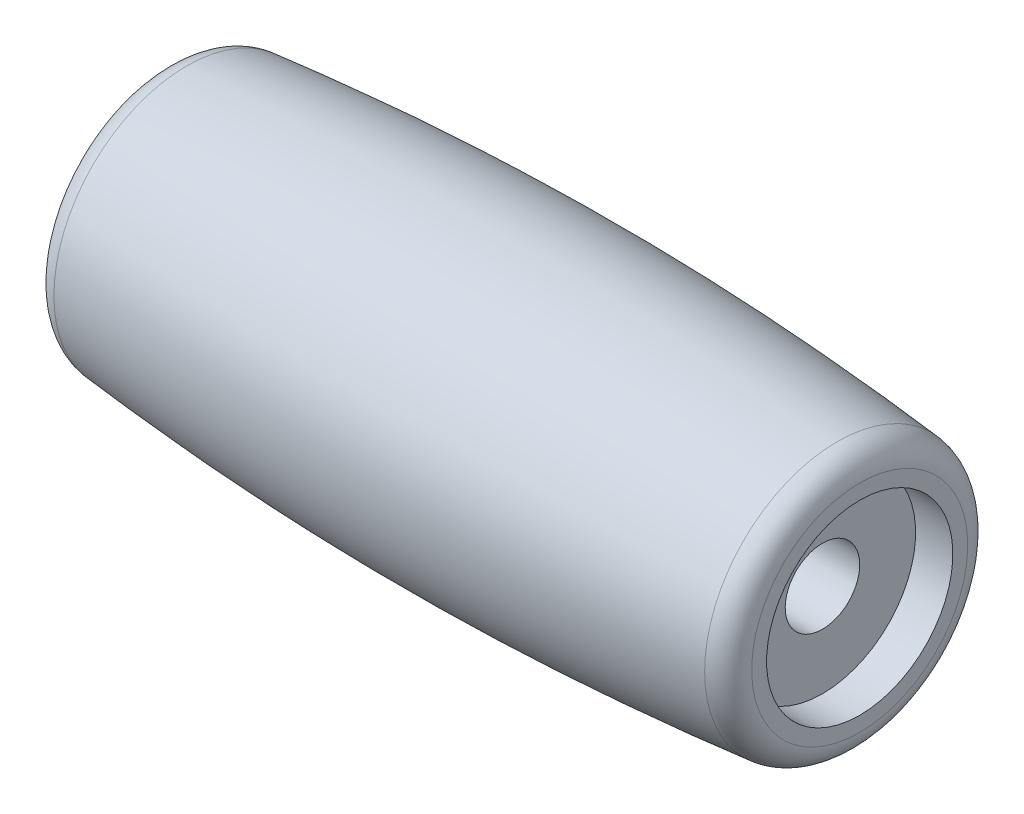
ISO-10303-21;
HEADER;
FILE_DESCRIPTION(('STEP AP214'),'2;1');
FILE_NAME('part.step','',(''),(''),'','','');
FILE_SCHEMA(('AUTOMOTIVE_DESIGN { 1 0 10303 214 1 1 1 1 }'));
ENDSEC;
DATA;
#1=APPLICATION_CONTEXT('core data for automotive mechanical design processes');
#2=APPLICATION_PROTOCOL_DEFINITION('international standard','automotive_design',2000,#1);
#3=PRODUCT_CONTEXT('',#1,'mechanical');
#4=PRODUCT('Part','Part','',(#3));
#5=PRODUCT_RELATED_PRODUCT_CATEGORY('part','',(#4));
#6=PRODUCT_DEFINITION_FORMATION('','',#4);
#7=PRODUCT_DEFINITION_CONTEXT('part definition',#1,'design');
#8=PRODUCT_DEFINITION('design','',#6,#7);
#9=PRODUCT_DEFINITION_SHAPE('','',#8);
#10=(LENGTH_UNIT() NAMED_UNIT(*) SI_UNIT(.MILLI.,.METRE.));
#11=(NAMED_UNIT(*) PLANE_ANGLE_UNIT() SI_UNIT($,.RADIAN.));
#12=(NAMED_UNIT(*) SI_UNIT($,.STERADIAN.) SOLID_ANGLE_UNIT());
#13=UNCERTAINTY_MEASURE_WITH_UNIT(LENGTH_MEASURE(1.E-05),#10,'distance_accuracy_value','');
#14=(GEOMETRIC_REPRESENTATION_CONTEXT(3) GLOBAL_UNCERTAINTY_ASSIGNED_CONTEXT((#13)) GLOBAL_UNIT_ASSIGNED_CONTEXT((#10,
#11,#12)) REPRESENTATION_CONTEXT('',''));
#15=CARTESIAN_POINT('',(0.,0.,0.));
#16=DIRECTION('',(0.,0.,1.));
#17=DIRECTION('',(1.,0.,0.));
#18=AXIS2_PLACEMENT_3D('',#15,#16,#17);
#19=CARTESIAN_POINT('',(-75.,0.,0.));
#20=DIRECTION('',(-1.,0.,0.));
#21=DIRECTION('',(0.,-1.,0.));
#22=AXIS2_PLACEMENT_3D('',#19,#20,#21);
#23=CYLINDRICAL_SURFACE('',#22,3.74999999999998);
#24=CARTESIAN_POINT('',(14.,0.,0.));
#25=DIRECTION('',(-1.,0.,0.));
#26=DIRECTION('',(0.,-1.,0.));
#27=AXIS2_PLACEMENT_3D('',#24,#25,#26);
#28=CIRCLE('',#27,3.74999999999998);
#29=CARTESIAN_POINT('',(14.,-3.74999999999997,0.));
#30=VERTEX_POINT('',#29);
#31=EDGE_CURVE('E10',#30,#30,#28,.T.);
#32=ORIENTED_EDGE('',*,*,#31,.F.);
#33=EDGE_LOOP('',(#32));
#34=FACE_BOUND('',#33,.T.);
#35=CARTESIAN_POINT('',(12.5,0.,0.));
#36=DIRECTION('',(-1.,0.,0.));
#37=DIRECTION('',(0.,-1.,0.));
#38=AXIS2_PLACEMENT_3D('',#35,#36,#37);
#39=CIRCLE('',#38,3.74999999999998);
#40=CARTESIAN_POINT('',(12.5,-3.74999999999997,0.));
#41=VERTEX_POINT('',#40);
#42=EDGE_CURVE('E82',#41,#41,#39,.T.);
#43=ORIENTED_EDGE('',*,*,#42,.T.);
#44=EDGE_LOOP('',(#43));
#45=FACE_BOUND('',#44,.T.);
#46=ADVANCED_FACE('F39',(#34,#45),#23,.F.);
#47=CARTESIAN_POINT('',(14.,3.75,0.));
#48=DIRECTION('',(-1.,0.,0.));
#49=DIRECTION('',(0.,-1.,0.));
#50=AXIS2_PLACEMENT_3D('',#47,#48,#49);
#51=PLANE('',#50);
#52=CARTESIAN_POINT('',(14.,0.,0.));
#53=DIRECTION('',(-1.,0.,0.));
#54=DIRECTION('',(0.,-1.,0.));
#55=AXIS2_PLACEMENT_3D('',#52,#53,#54);
#56=CIRCLE('',#55,4.34837271287945);
#57=CARTESIAN_POINT('',(14.,-4.34837271287943,0.));
#58=VERTEX_POINT('',#57);
#59=EDGE_CURVE('E46',#58,#58,#56,.T.);
#60=ORIENTED_EDGE('',*,*,#59,.F.);
#61=EDGE_LOOP('',(#60));
#62=FACE_BOUND('',#61,.T.);
#63=ORIENTED_EDGE('',*,*,#31,.T.);
#64=EDGE_LOOP('',(#63));
#65=FACE_BOUND('',#64,.T.);
#66=ADVANCED_FACE('F102',(#62,#65),#51,.F.);
#67=CARTESIAN_POINT('',(13.,0.,0.));
#68=DIRECTION('',(-1.,0.,0.));
#69=DIRECTION('',(0.,-1.,0.));
#70=AXIS2_PLACEMENT_3D('',#67,#68,#69);
#71=TOROIDAL_SURFACE('',#70,4.34837271287945,0.999999999999998);
#72=CARTESIAN_POINT('',(13.0997827464215,0.,0.));
#73=DIRECTION('',(-1.,0.,0.));
#74=DIRECTION('',(0.,-1.,0.));
#75=AXIS2_PLACEMENT_3D('',#72,#73,#74);
#76=CIRCLE('',#75,5.34338196083475);
#77=CARTESIAN_POINT('',(13.0997827464215,-5.34338196083474,0.));
#78=VERTEX_POINT('',#77);
#79=EDGE_CURVE('E51',#78,#78,#76,.T.);
#80=ORIENTED_EDGE('',*,*,#79,.F.);
#81=EDGE_LOOP('',(#80));
#82=FACE_BOUND('',#81,.T.);
#83=ORIENTED_EDGE('',*,*,#59,.T.);
#84=EDGE_LOOP('',(#83));
#85=FACE_BOUND('',#84,.T.);
#86=ADVANCED_FACE('F98',(#82,#85),#71,.T.);
#87=CARTESIAN_POINT('',(13.0997827464215,5.34338196083477,0.));
#88=CARTESIAN_POINT('',(8.73325813857914,5.7812711750134,0.));
#89=CARTESIAN_POINT('',(0.000693828203650842,6.21879840432353,0.));
#90=CARTESIAN_POINT('',(-8.73464579498644,5.78113201633955,0.));
#91=CARTESIAN_POINT('',(-13.0997827464215,5.34338196083477,0.));
#92=B_SPLINE_CURVE_WITH_KNOTS('',3,(#87,#88,#89,#90,#91),.UNSPECIFIED.,.F.,.F.,(4,1,4),
(0.0321516724495388,0.499994989031193,0.967838305612847),.UNSPECIFIED.);
#93=CARTESIAN_POINT('',(-75.,0.,0.));
#94=DIRECTION('',(-1.,0.,0.));
#95=AXIS1_PLACEMENT('',#93,#94);
#96=SURFACE_OF_REVOLUTION('',#92,#95);
#97=CARTESIAN_POINT('',(-13.0997827464215,0.,0.));
#98=DIRECTION('',(-1.,0.,0.));
#99=DIRECTION('',(0.,-1.,0.));
#100=AXIS2_PLACEMENT_3D('',#97,#98,#99);
#101=CIRCLE('',#100,5.34338196083476);
#102=CARTESIAN_POINT('',(-13.0997827464215,-5.34338196083475,0.));
#103=VERTEX_POINT('',#102);
#104=EDGE_CURVE('E56',#103,#103,#101,.T.);
#105=ORIENTED_EDGE('',*,*,#104,.F.);
#106=EDGE_LOOP('',(#105));
#107=FACE_BOUND('',#106,.T.);
#108=ORIENTED_EDGE('',*,*,#79,.T.);
#109=EDGE_LOOP('',(#108));
#110=FACE_BOUND('',#109,.T.);
#111=ADVANCED_FACE('F93',(#107,#110),#96,.T.);
#112=CARTESIAN_POINT('',(-13.,0.,0.));
#113=DIRECTION('',(-1.,0.,0.));
#114=DIRECTION('',(0.,-1.,0.));
#115=AXIS2_PLACEMENT_3D('',#112,#113,#114);
#116=TOROIDAL_SURFACE('',#115,4.34837271287945,1.);
#117=CARTESIAN_POINT('',(-14.,0.,0.));
#118=DIRECTION('',(-1.,0.,0.));
#119=DIRECTION('',(0.,-1.,0.));
#120=AXIS2_PLACEMENT_3D('',#117,#118,#119);
#121=CIRCLE('',#120,4.34837271287945);
#122=CARTESIAN_POINT('',(-14.,-4.34837271287944,0.));
#123=VERTEX_POINT('',#122);
#124=EDGE_CURVE('E62',#123,#123,#121,.T.);
#125=ORIENTED_EDGE('',*,*,#124,.F.);
#126=EDGE_LOOP('',(#125));
#127=FACE_BOUND('',#126,.T.);
#128=ORIENTED_EDGE('',*,*,#104,.T.);
#129=EDGE_LOOP('',(#128));
#130=FACE_BOUND('',#129,.T.);
#131=ADVANCED_FACE('F97',(#127,#130),#116,.T.);
#132=CARTESIAN_POINT('',(-14.,3.75,0.));
#133=DIRECTION('',(1.,0.,0.));
#134=DIRECTION('',(0.,1.,0.));
#135=AXIS2_PLACEMENT_3D('',#132,#133,#134);
#136=PLANE('',#135);
#137=CARTESIAN_POINT('',(-14.,0.,0.));
#138=DIRECTION('',(-1.,0.,0.));
#139=DIRECTION('',(0.,-1.,0.));
#140=AXIS2_PLACEMENT_3D('',#137,#138,#139);
#141=CIRCLE('',#140,3.74999999999999);
#142=CARTESIAN_POINT('',(-14.,-3.74999999999998,0.));
#143=VERTEX_POINT('',#142);
#144=EDGE_CURVE('E66',#143,#143,#141,.T.);
#145=ORIENTED_EDGE('',*,*,#144,.F.);
#146=EDGE_LOOP('',(#145));
#147=FACE_BOUND('',#146,.T.);
#148=ORIENTED_EDGE('',*,*,#124,.T.);
#149=EDGE_LOOP('',(#148));
#150=FACE_BOUND('',#149,.T.);
#151=ADVANCED_FACE('F136',(#147,#150),#136,.F.);
#152=CARTESIAN_POINT('',(-75.,0.,0.));
#153=DIRECTION('',(-1.,0.,0.));
#154=DIRECTION('',(0.,-1.,0.));
#155=AXIS2_PLACEMENT_3D('',#152,#153,#154);
#156=CYLINDRICAL_SURFACE('',#155,3.74999999999999);
#157=CARTESIAN_POINT('',(-12.5,0.,0.));
#158=DIRECTION('',(-1.,0.,0.));
#159=DIRECTION('',(0.,-1.,0.));
#160=AXIS2_PLACEMENT_3D('',#157,#158,#159);
#161=CIRCLE('',#160,3.74999999999999);
#162=CARTESIAN_POINT('',(-12.5,-3.74999999999998,0.));
#163=VERTEX_POINT('',#162);
#164=EDGE_CURVE('E70',#163,#163,#161,.T.);
#165=ORIENTED_EDGE('',*,*,#164,.F.);
#166=EDGE_LOOP('',(#165));
#167=FACE_BOUND('',#166,.T.);
#168=ORIENTED_EDGE('',*,*,#144,.T.);
#169=EDGE_LOOP('',(#168));
#170=FACE_BOUND('',#169,.T.);
#171=ADVANCED_FACE('F130',(#167,#170),#156,.F.);
#172=CARTESIAN_POINT('',(-12.5,1.5,0.));
#173=DIRECTION('',(1.,0.,0.));
#174=DIRECTION('',(0.,1.,0.));
#175=AXIS2_PLACEMENT_3D('',#172,#173,#174);
#176=PLANE('',#175);
#177=CARTESIAN_POINT('',(-12.5,0.,0.));
#178=DIRECTION('',(-1.,0.,0.));
#179=DIRECTION('',(0.,-1.,0.));
#180=AXIS2_PLACEMENT_3D('',#177,#178,#179);
#181=CIRCLE('',#180,1.49999999999999);
#182=CARTESIAN_POINT('',(-12.5,-1.49999999999998,0.));
#183=VERTEX_POINT('',#182);
#184=EDGE_CURVE('E74',#183,#183,#181,.T.);
#185=ORIENTED_EDGE('',*,*,#184,.F.);
#186=EDGE_LOOP('',(#185));
#187=FACE_BOUND('',#186,.T.);
#188=ORIENTED_EDGE('',*,*,#164,.T.);
#189=EDGE_LOOP('',(#188));
#190=FACE_BOUND('',#189,.T.);
#191=ADVANCED_FACE('F124',(#187,#190),#176,.F.);
#192=CARTESIAN_POINT('',(-75.,0.,0.));
#193=DIRECTION('',(-1.,0.,0.));
#194=DIRECTION('',(0.,-1.,0.));
#195=AXIS2_PLACEMENT_3D('',#192,#193,#194);
#196=CYLINDRICAL_SURFACE('',#195,1.49999999999999);
#197=CARTESIAN_POINT('',(12.5,0.,0.));
#198=DIRECTION('',(-1.,0.,0.));
#199=DIRECTION('',(0.,-1.,0.));
#200=AXIS2_PLACEMENT_3D('',#197,#198,#199);
#201=CIRCLE('',#200,1.49999999999998);
#202=CARTESIAN_POINT('',(12.5,-1.49999999999997,0.));
#203=VERTEX_POINT('',#202);
#204=EDGE_CURVE('E78',#203,#203,#201,.T.);
#205=ORIENTED_EDGE('',*,*,#204,.F.);
#206=EDGE_LOOP('',(#205));
#207=FACE_BOUND('',#206,.T.);
#208=ORIENTED_EDGE('',*,*,#184,.T.);
#209=EDGE_LOOP('',(#208));
#210=FACE_BOUND('',#209,.T.);
#211=ADVANCED_FACE('F118',(#207,#210),#196,.F.);
#212=CARTESIAN_POINT('',(12.5,1.5,0.));
#213=DIRECTION('',(-1.,0.,0.));
#214=DIRECTION('',(0.,-1.,0.));
#215=AXIS2_PLACEMENT_3D('',#212,#213,#214);
#216=PLANE('',#215);
#217=ORIENTED_EDGE('',*,*,#42,.F.);
#218=EDGE_LOOP('',(#217));
#219=FACE_BOUND('',#218,.T.);
#220=ORIENTED_EDGE('',*,*,#204,.T.);
#221=EDGE_LOOP('',(#220));
#222=FACE_BOUND('',#221,.T.);
#223=ADVANCED_FACE('F115',(#219,#222),#216,.F.);
#224=CLOSED_SHELL('',(#46,#66,#86,#111,#131,#151,#171,#191,#211,#223));
#225=MANIFOLD_SOLID_BREP('B2',#224);
#226=ADVANCED_BREP_SHAPE_REPRESENTATION('',(#18,#225),#14);
#227=SHAPE_DEFINITION_REPRESENTATION(#9,#226);
ENDSEC;
END-ISO-10303-21;
